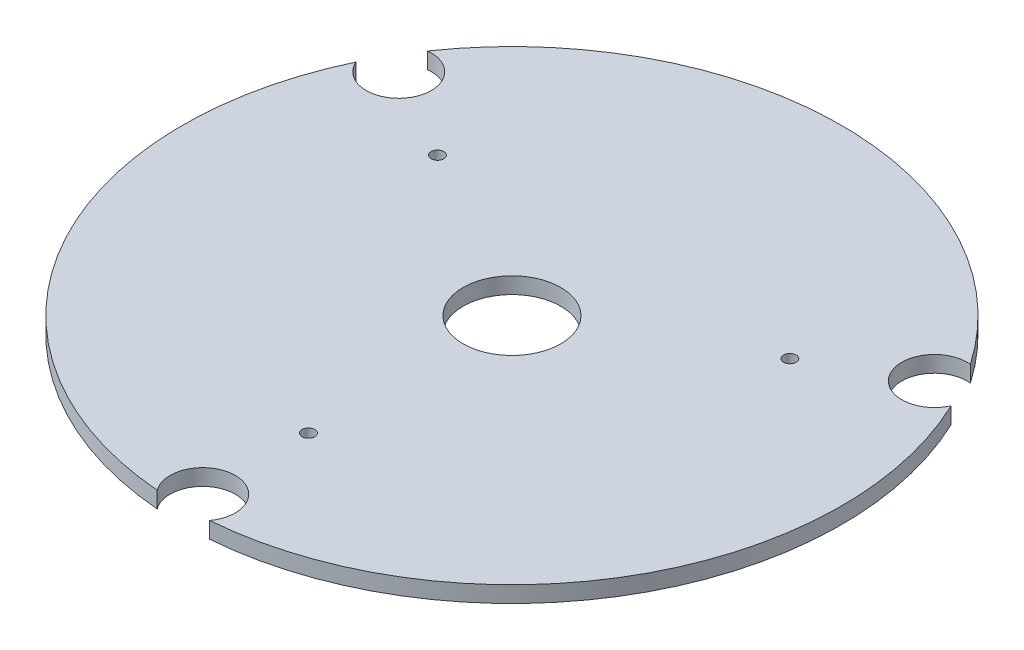
ISO-10303-21;
HEADER;
FILE_DESCRIPTION(('STEP AP214'),'2;1');
FILE_NAME('part.step','',(''),(''),'','','');
FILE_SCHEMA(('AUTOMOTIVE_DESIGN { 1 0 10303 214 1 1 1 1 }'));
ENDSEC;
DATA;
#1=APPLICATION_CONTEXT('core data for automotive mechanical design processes');
#2=APPLICATION_PROTOCOL_DEFINITION('international standard','automotive_design',2000,#1);
#3=PRODUCT_CONTEXT('',#1,'mechanical');
#4=PRODUCT('Part','Part','',(#3));
#5=PRODUCT_RELATED_PRODUCT_CATEGORY('part','',(#4));
#6=PRODUCT_DEFINITION_FORMATION('','',#4);
#7=PRODUCT_DEFINITION_CONTEXT('part definition',#1,'design');
#8=PRODUCT_DEFINITION('design','',#6,#7);
#9=PRODUCT_DEFINITION_SHAPE('','',#8);
#10=(LENGTH_UNIT() NAMED_UNIT(*) SI_UNIT(.MILLI.,.METRE.));
#11=(NAMED_UNIT(*) PLANE_ANGLE_UNIT() SI_UNIT($,.RADIAN.));
#12=(NAMED_UNIT(*) SI_UNIT($,.STERADIAN.) SOLID_ANGLE_UNIT());
#13=UNCERTAINTY_MEASURE_WITH_UNIT(LENGTH_MEASURE(1.E-05),#10,'distance_accuracy_value','');
#14=(GEOMETRIC_REPRESENTATION_CONTEXT(3) GLOBAL_UNCERTAINTY_ASSIGNED_CONTEXT((#13)) GLOBAL_UNIT_ASSIGNED_CONTEXT((#10,
#11,#12)) REPRESENTATION_CONTEXT('',''));
#15=CARTESIAN_POINT('',(0.,0.,0.));
#16=DIRECTION('',(0.,0.,1.));
#17=DIRECTION('',(1.,0.,0.));
#18=AXIS2_PLACEMENT_3D('',#15,#16,#17);
#19=CARTESIAN_POINT('',(0.,2.,0.));
#20=DIRECTION('',(0.,-1.,0.));
#21=DIRECTION('',(0.,0.,-1.));
#22=AXIS2_PLACEMENT_3D('',#19,#20,#21);
#23=CYLINDRICAL_SURFACE('',#22,81.);
#24=CARTESIAN_POINT('',(0.,-2.,0.));
#25=DIRECTION('',(0.,1.,0.));
#26=DIRECTION('',(0.,0.,1.));
#27=AXIS2_PLACEMENT_3D('',#24,#25,#26);
#28=CIRCLE('',#27,81.);
#29=CARTESIAN_POINT('',(66.7048308180494,-2.,-45.9506860181151));
#30=VERTEX_POINT('',#29);
#31=CARTESIAN_POINT('',(-66.7048308180501,-2.,-45.9506860181142));
#32=VERTEX_POINT('',#31);
#33=EDGE_CURVE('E99',#30,#32,#28,.T.);
#34=ORIENTED_EDGE('',*,*,#33,.T.);
#35=DIRECTION('',(0.,-1.,0.));
#36=VECTOR('',#35,1.);
#37=CARTESIAN_POINT('',(-66.7048308180501,2.,-45.9506860181142));
#38=LINE('',#37,#36);
#39=CARTESIAN_POINT('',(-66.7048308180501,2.,-45.9506860181142));
#40=VERTEX_POINT('',#39);
#41=EDGE_CURVE('E88',#40,#32,#38,.T.);
#42=ORIENTED_EDGE('',*,*,#41,.F.);
#43=CARTESIAN_POINT('',(0.,2.,0.));
#44=DIRECTION('',(0.,1.,0.));
#45=DIRECTION('',(0.,0.,1.));
#46=AXIS2_PLACEMENT_3D('',#43,#44,#45);
#47=CIRCLE('',#46,81.);
#48=CARTESIAN_POINT('',(66.7048308180494,2.,-45.9506860181151));
#49=VERTEX_POINT('',#48);
#50=EDGE_CURVE('E41',#49,#40,#47,.T.);
#51=ORIENTED_EDGE('',*,*,#50,.F.);
#52=DIRECTION('',(0.,-1.,0.));
#53=VECTOR('',#52,1.);
#54=CARTESIAN_POINT('',(66.7048308180494,2.,-45.9506860181151));
#55=LINE('',#54,#53);
#56=EDGE_CURVE('E131',#49,#30,#55,.T.);
#57=ORIENTED_EDGE('',*,*,#56,.T.);
#58=EDGE_LOOP('',(#34,#42,#51,#57));
#59=FACE_BOUND('',#58,.T.);
#60=ADVANCED_FACE('F32',(#59),#23,.T.);
#61=CARTESIAN_POINT('',(-73.1468768220345,2.,-34.792735034517));
#62=VERTEX_POINT('',#61);
#63=CARTESIAN_POINT('',(-6.44204600398389,2.,80.7434210526316));
#64=VERTEX_POINT('',#63);
#65=EDGE_CURVE('E42',#62,#64,#47,.T.);
#66=ORIENTED_EDGE('',*,*,#65,.F.);
#67=DIRECTION('',(0.,-1.,0.));
#68=VECTOR('',#67,1.);
#69=CARTESIAN_POINT('',(-73.1468768220345,2.,-34.792735034517));
#70=LINE('',#69,#68);
#71=CARTESIAN_POINT('',(-73.1468768220345,-2.,-34.792735034517));
#72=VERTEX_POINT('',#71);
#73=EDGE_CURVE('E89',#62,#72,#70,.T.);
#74=ORIENTED_EDGE('',*,*,#73,.T.);
#75=CARTESIAN_POINT('',(-6.44204600398389,-2.,80.7434210526316));
#76=VERTEX_POINT('',#75);
#77=EDGE_CURVE('E113',#72,#76,#28,.T.);
#78=ORIENTED_EDGE('',*,*,#77,.T.);
#79=DIRECTION('',(0.,-1.,0.));
#80=VECTOR('',#79,1.);
#81=CARTESIAN_POINT('',(-6.44204600398389,2.,80.7434210526316));
#82=LINE('',#81,#80);
#83=EDGE_CURVE('E138',#64,#76,#82,.T.);
#84=ORIENTED_EDGE('',*,*,#83,.F.);
#85=EDGE_LOOP('',(#66,#74,#78,#84));
#86=FACE_BOUND('',#85,.T.);
#87=ADVANCED_FACE('F151',(#86),#23,.T.);
#88=CARTESIAN_POINT('',(0.,2.,0.));
#89=DIRECTION('',(0.,1.,0.));
#90=DIRECTION('',(0.,0.,1.));
#91=AXIS2_PLACEMENT_3D('',#88,#89,#90);
#92=PLANE('',#91);
#93=CARTESIAN_POINT('',(-65.8179306876174,2.,-37.9999999999998));
#94=DIRECTION('',(0.,-1.,0.));
#95=DIRECTION('',(0.,0.,-1.));
#96=AXIS2_PLACEMENT_3D('',#93,#94,#95);
#97=CIRCLE('',#96,8.00000000000004);
#98=EDGE_CURVE('E85',#40,#62,#97,.T.);
#99=ORIENTED_EDGE('',*,*,#98,.T.);
#100=ORIENTED_EDGE('',*,*,#65,.T.);
#101=CARTESIAN_POINT('',(5.34294830600857E-13,2.,76.));
#102=DIRECTION('',(0.,-1.,0.));
#103=DIRECTION('',(0.,0.,-1.));
#104=AXIS2_PLACEMENT_3D('',#101,#102,#103);
#105=CIRCLE('',#104,8.00000000000004);
#106=CARTESIAN_POINT('',(6.44204600398503,2.,80.7434210526315));
#107=VERTEX_POINT('',#106);
#108=EDGE_CURVE('E141',#64,#107,#105,.T.);
#109=ORIENTED_EDGE('',*,*,#108,.T.);
#110=CARTESIAN_POINT('',(73.146876822034,2.,-34.7927350345181));
#111=VERTEX_POINT('',#110);
#112=EDGE_CURVE('E11',#107,#111,#47,.T.);
#113=ORIENTED_EDGE('',*,*,#112,.T.);
#114=CARTESIAN_POINT('',(65.8179306876169,2.,-38.0000000000007));
#115=DIRECTION('',(0.,-1.,0.));
#116=DIRECTION('',(0.,0.,-1.));
#117=AXIS2_PLACEMENT_3D('',#114,#115,#116);
#118=CIRCLE('',#117,8.00000000000004);
#119=EDGE_CURVE('E104',#111,#49,#118,.T.);
#120=ORIENTED_EDGE('',*,*,#119,.T.);
#121=ORIENTED_EDGE('',*,*,#50,.T.);
#122=EDGE_LOOP('',(#99,#100,#109,#113,#120,#121));
#123=FACE_BOUND('',#122,.T.);
#124=CARTESIAN_POINT('',(3.03687088063127E-12,2.,50.0000000000018));
#125=DIRECTION('',(0.,1.,0.));
#126=DIRECTION('',(0.,0.,1.));
#127=AXIS2_PLACEMENT_3D('',#124,#125,#126);
#128=CIRCLE('',#127,1.54999999999898);
#129=CARTESIAN_POINT('',(3.03687088063127E-12,2.,51.5500000000008));
#130=VERTEX_POINT('',#129);
#131=EDGE_CURVE('E117',#130,#130,#128,.T.);
#132=ORIENTED_EDGE('',*,*,#131,.F.);
#133=EDGE_LOOP('',(#132));
#134=FACE_BOUND('',#133,.T.);
#135=CARTESIAN_POINT('',(43.301270189222,2.,-24.9999999999999));
#136=DIRECTION('',(0.,1.,0.));
#137=DIRECTION('',(0.,0.,1.));
#138=AXIS2_PLACEMENT_3D('',#135,#136,#137);
#139=CIRCLE('',#138,1.55);
#140=CARTESIAN_POINT('',(43.301270189222,2.,-23.4499999999999));
#141=VERTEX_POINT('',#140);
#142=EDGE_CURVE('E109',#141,#141,#139,.T.);
#143=ORIENTED_EDGE('',*,*,#142,.F.);
#144=EDGE_LOOP('',(#143));
#145=FACE_BOUND('',#144,.T.);
#146=CARTESIAN_POINT('',(0.,2.,0.));
#147=DIRECTION('',(0.,1.,0.));
#148=DIRECTION('',(0.,0.,1.));
#149=AXIS2_PLACEMENT_3D('',#146,#147,#148);
#150=CIRCLE('',#149,12.);
#151=CARTESIAN_POINT('',(0.,2.,12.));
#152=VERTEX_POINT('',#151);
#153=EDGE_CURVE('E110',#152,#152,#150,.T.);
#154=ORIENTED_EDGE('',*,*,#153,.F.);
#155=EDGE_LOOP('',(#154));
#156=FACE_BOUND('',#155,.T.);
#157=CARTESIAN_POINT('',(-43.3012701892219,2.,-24.9999999999964));
#158=DIRECTION('',(0.,1.,0.));
#159=DIRECTION('',(0.,0.,1.));
#160=AXIS2_PLACEMENT_3D('',#157,#158,#159);
#161=CIRCLE('',#160,1.55000000000257);
#162=CARTESIAN_POINT('',(-43.3012701892219,2.,-23.4499999999939));
#163=VERTEX_POINT('',#162);
#164=EDGE_CURVE('E123',#163,#163,#161,.T.);
#165=ORIENTED_EDGE('',*,*,#164,.F.);
#166=EDGE_LOOP('',(#165));
#167=FACE_BOUND('',#166,.T.);
#168=ADVANCED_FACE('F102',(#123,#134,#145,#156,#167),#92,.T.);
#169=CARTESIAN_POINT('',(0.,-2.,0.));
#170=DIRECTION('',(0.,1.,0.));
#171=DIRECTION('',(0.,0.,1.));
#172=AXIS2_PLACEMENT_3D('',#169,#170,#171);
#173=PLANE('',#172);
#174=ORIENTED_EDGE('',*,*,#77,.F.);
#175=CARTESIAN_POINT('',(-65.8179306876174,-2.,-37.9999999999998));
#176=DIRECTION('',(0.,-1.,0.));
#177=DIRECTION('',(0.,0.,-1.));
#178=AXIS2_PLACEMENT_3D('',#175,#176,#177);
#179=CIRCLE('',#178,8.00000000000004);
#180=EDGE_CURVE('E49',#32,#72,#179,.T.);
#181=ORIENTED_EDGE('',*,*,#180,.F.);
#182=ORIENTED_EDGE('',*,*,#33,.F.);
#183=CARTESIAN_POINT('',(65.8179306876169,-2.,-38.0000000000007));
#184=DIRECTION('',(0.,-1.,0.));
#185=DIRECTION('',(0.,0.,-1.));
#186=AXIS2_PLACEMENT_3D('',#183,#184,#185);
#187=CIRCLE('',#186,8.00000000000004);
#188=CARTESIAN_POINT('',(73.146876822034,-2.,-34.7927350345181));
#189=VERTEX_POINT('',#188);
#190=EDGE_CURVE('E57',#189,#30,#187,.T.);
#191=ORIENTED_EDGE('',*,*,#190,.F.);
#192=CARTESIAN_POINT('',(6.44204600398503,-2.,80.7434210526315));
#193=VERTEX_POINT('',#192);
#194=EDGE_CURVE('E36',#193,#189,#28,.T.);
#195=ORIENTED_EDGE('',*,*,#194,.F.);
#196=CARTESIAN_POINT('',(5.34294830600857E-13,-2.,76.));
#197=DIRECTION('',(0.,-1.,0.));
#198=DIRECTION('',(0.,0.,-1.));
#199=AXIS2_PLACEMENT_3D('',#196,#197,#198);
#200=CIRCLE('',#199,8.00000000000004);
#201=EDGE_CURVE('E135',#76,#193,#200,.T.);
#202=ORIENTED_EDGE('',*,*,#201,.F.);
#203=EDGE_LOOP('',(#174,#181,#182,#191,#195,#202));
#204=FACE_BOUND('',#203,.T.);
#205=CARTESIAN_POINT('',(43.301270189222,-2.,-24.9999999999999));
#206=DIRECTION('',(0.,1.,0.));
#207=DIRECTION('',(0.,0.,1.));
#208=AXIS2_PLACEMENT_3D('',#205,#206,#207);
#209=CIRCLE('',#208,1.55);
#210=CARTESIAN_POINT('',(43.301270189222,-2.,-23.4499999999999));
#211=VERTEX_POINT('',#210);
#212=EDGE_CURVE('E106',#211,#211,#209,.T.);
#213=ORIENTED_EDGE('',*,*,#212,.T.);
#214=EDGE_LOOP('',(#213));
#215=FACE_BOUND('',#214,.T.);
#216=CARTESIAN_POINT('',(0.,-2.,0.));
#217=DIRECTION('',(0.,1.,0.));
#218=DIRECTION('',(0.,0.,1.));
#219=AXIS2_PLACEMENT_3D('',#216,#217,#218);
#220=CIRCLE('',#219,12.);
#221=CARTESIAN_POINT('',(0.,-2.,12.));
#222=VERTEX_POINT('',#221);
#223=EDGE_CURVE('E114',#222,#222,#220,.T.);
#224=ORIENTED_EDGE('',*,*,#223,.T.);
#225=EDGE_LOOP('',(#224));
#226=FACE_BOUND('',#225,.T.);
#227=CARTESIAN_POINT('',(3.03687088063127E-12,-2.,50.0000000000018));
#228=DIRECTION('',(0.,1.,0.));
#229=DIRECTION('',(0.,0.,1.));
#230=AXIS2_PLACEMENT_3D('',#227,#228,#229);
#231=CIRCLE('',#230,1.54999999999898);
#232=CARTESIAN_POINT('',(3.03687088063127E-12,-2.,51.5500000000008));
#233=VERTEX_POINT('',#232);
#234=EDGE_CURVE('E120',#233,#233,#231,.T.);
#235=ORIENTED_EDGE('',*,*,#234,.T.);
#236=EDGE_LOOP('',(#235));
#237=FACE_BOUND('',#236,.T.);
#238=CARTESIAN_POINT('',(-43.3012701892219,-2.,-24.9999999999964));
#239=DIRECTION('',(0.,1.,0.));
#240=DIRECTION('',(0.,0.,1.));
#241=AXIS2_PLACEMENT_3D('',#238,#239,#240);
#242=CIRCLE('',#241,1.55000000000257);
#243=CARTESIAN_POINT('',(-43.3012701892219,-2.,-23.4499999999939));
#244=VERTEX_POINT('',#243);
#245=EDGE_CURVE('E126',#244,#244,#242,.T.);
#246=ORIENTED_EDGE('',*,*,#245,.T.);
#247=EDGE_LOOP('',(#246));
#248=FACE_BOUND('',#247,.T.);
#249=ADVANCED_FACE('F155',(#204,#215,#226,#237,#248),#173,.F.);
#250=ORIENTED_EDGE('',*,*,#112,.F.);
#251=DIRECTION('',(0.,-1.,0.));
#252=VECTOR('',#251,1.);
#253=CARTESIAN_POINT('',(6.44204600398503,2.,80.7434210526315));
#254=LINE('',#253,#252);
#255=EDGE_CURVE('E140',#107,#193,#254,.T.);
#256=ORIENTED_EDGE('',*,*,#255,.T.);
#257=ORIENTED_EDGE('',*,*,#194,.T.);
#258=DIRECTION('',(0.,-1.,0.));
#259=VECTOR('',#258,1.);
#260=CARTESIAN_POINT('',(73.146876822034,2.,-34.7927350345181));
#261=LINE('',#260,#259);
#262=EDGE_CURVE('E133',#111,#189,#261,.T.);
#263=ORIENTED_EDGE('',*,*,#262,.F.);
#264=EDGE_LOOP('',(#250,#256,#257,#263));
#265=FACE_BOUND('',#264,.T.);
#266=ADVANCED_FACE('F34',(#265),#23,.T.);
#267=CARTESIAN_POINT('',(43.301270189222,2.,-24.9999999999999));
#268=DIRECTION('',(0.,-1.,0.));
#269=DIRECTION('',(0.,0.,-1.));
#270=AXIS2_PLACEMENT_3D('',#267,#268,#269);
#271=CYLINDRICAL_SURFACE('',#270,1.55);
#272=ORIENTED_EDGE('',*,*,#142,.T.);
#273=EDGE_LOOP('',(#272));
#274=FACE_BOUND('',#273,.T.);
#275=ORIENTED_EDGE('',*,*,#212,.F.);
#276=EDGE_LOOP('',(#275));
#277=FACE_BOUND('',#276,.T.);
#278=ADVANCED_FACE('F179',(#274,#277),#271,.F.);
#279=CARTESIAN_POINT('',(0.,2.,0.));
#280=DIRECTION('',(0.,-1.,0.));
#281=DIRECTION('',(0.,0.,-1.));
#282=AXIS2_PLACEMENT_3D('',#279,#280,#281);
#283=CYLINDRICAL_SURFACE('',#282,12.);
#284=ORIENTED_EDGE('',*,*,#153,.T.);
#285=EDGE_LOOP('',(#284));
#286=FACE_BOUND('',#285,.T.);
#287=ORIENTED_EDGE('',*,*,#223,.F.);
#288=EDGE_LOOP('',(#287));
#289=FACE_BOUND('',#288,.T.);
#290=ADVANCED_FACE('F184',(#286,#289),#283,.F.);
#291=CARTESIAN_POINT('',(3.03687088063127E-12,2.,50.0000000000018));
#292=DIRECTION('',(0.,-1.,0.));
#293=DIRECTION('',(0.,0.,-1.));
#294=AXIS2_PLACEMENT_3D('',#291,#292,#293);
#295=CYLINDRICAL_SURFACE('',#294,1.54999999999898);
#296=ORIENTED_EDGE('',*,*,#131,.T.);
#297=EDGE_LOOP('',(#296));
#298=FACE_BOUND('',#297,.T.);
#299=ORIENTED_EDGE('',*,*,#234,.F.);
#300=EDGE_LOOP('',(#299));
#301=FACE_BOUND('',#300,.T.);
#302=ADVANCED_FACE('F194',(#298,#301),#295,.F.);
#303=CARTESIAN_POINT('',(-43.3012701892219,2.,-24.9999999999964));
#304=DIRECTION('',(0.,-1.,0.));
#305=DIRECTION('',(0.,0.,-1.));
#306=AXIS2_PLACEMENT_3D('',#303,#304,#305);
#307=CYLINDRICAL_SURFACE('',#306,1.55000000000257);
#308=ORIENTED_EDGE('',*,*,#164,.T.);
#309=EDGE_LOOP('',(#308));
#310=FACE_BOUND('',#309,.T.);
#311=ORIENTED_EDGE('',*,*,#245,.F.);
#312=EDGE_LOOP('',(#311));
#313=FACE_BOUND('',#312,.T.);
#314=ADVANCED_FACE('F172',(#310,#313),#307,.F.);
#315=CARTESIAN_POINT('',(65.8179306876169,2.,-38.0000000000007));
#316=DIRECTION('',(0.,-1.,0.));
#317=DIRECTION('',(0.,0.,-1.));
#318=AXIS2_PLACEMENT_3D('',#315,#316,#317);
#319=CYLINDRICAL_SURFACE('',#318,8.00000000000004);
#320=ORIENTED_EDGE('',*,*,#190,.T.);
#321=ORIENTED_EDGE('',*,*,#56,.F.);
#322=ORIENTED_EDGE('',*,*,#119,.F.);
#323=ORIENTED_EDGE('',*,*,#262,.T.);
#324=EDGE_LOOP('',(#320,#321,#322,#323));
#325=FACE_BOUND('',#324,.T.);
#326=ADVANCED_FACE('F165',(#325),#319,.F.);
#327=CARTESIAN_POINT('',(5.34294830600857E-13,2.,76.));
#328=DIRECTION('',(0.,-1.,0.));
#329=DIRECTION('',(0.,0.,-1.));
#330=AXIS2_PLACEMENT_3D('',#327,#328,#329);
#331=CYLINDRICAL_SURFACE('',#330,8.00000000000004);
#332=ORIENTED_EDGE('',*,*,#201,.T.);
#333=ORIENTED_EDGE('',*,*,#255,.F.);
#334=ORIENTED_EDGE('',*,*,#108,.F.);
#335=ORIENTED_EDGE('',*,*,#83,.T.);
#336=EDGE_LOOP('',(#332,#333,#334,#335));
#337=FACE_BOUND('',#336,.T.);
#338=ADVANCED_FACE('F163',(#337),#331,.F.);
#339=CARTESIAN_POINT('',(-65.8179306876174,2.,-37.9999999999998));
#340=DIRECTION('',(0.,-1.,0.));
#341=DIRECTION('',(0.,0.,-1.));
#342=AXIS2_PLACEMENT_3D('',#339,#340,#341);
#343=CYLINDRICAL_SURFACE('',#342,8.00000000000004);
#344=ORIENTED_EDGE('',*,*,#180,.T.);
#345=ORIENTED_EDGE('',*,*,#73,.F.);
#346=ORIENTED_EDGE('',*,*,#98,.F.);
#347=ORIENTED_EDGE('',*,*,#41,.T.);
#348=EDGE_LOOP('',(#344,#345,#346,#347));
#349=FACE_BOUND('',#348,.T.);
#350=ADVANCED_FACE('F87',(#349),#343,.F.);
#351=CLOSED_SHELL('',(#60,#87,#168,#249,#266,#278,#290,#302,#314,#326,#338,#350));
#352=MANIFOLD_SOLID_BREP('B2',#351);
#353=ADVANCED_BREP_SHAPE_REPRESENTATION('',(#18,#352),#14);
#354=SHAPE_DEFINITION_REPRESENTATION(#9,#353);
ENDSEC;
END-ISO-10303-21;
